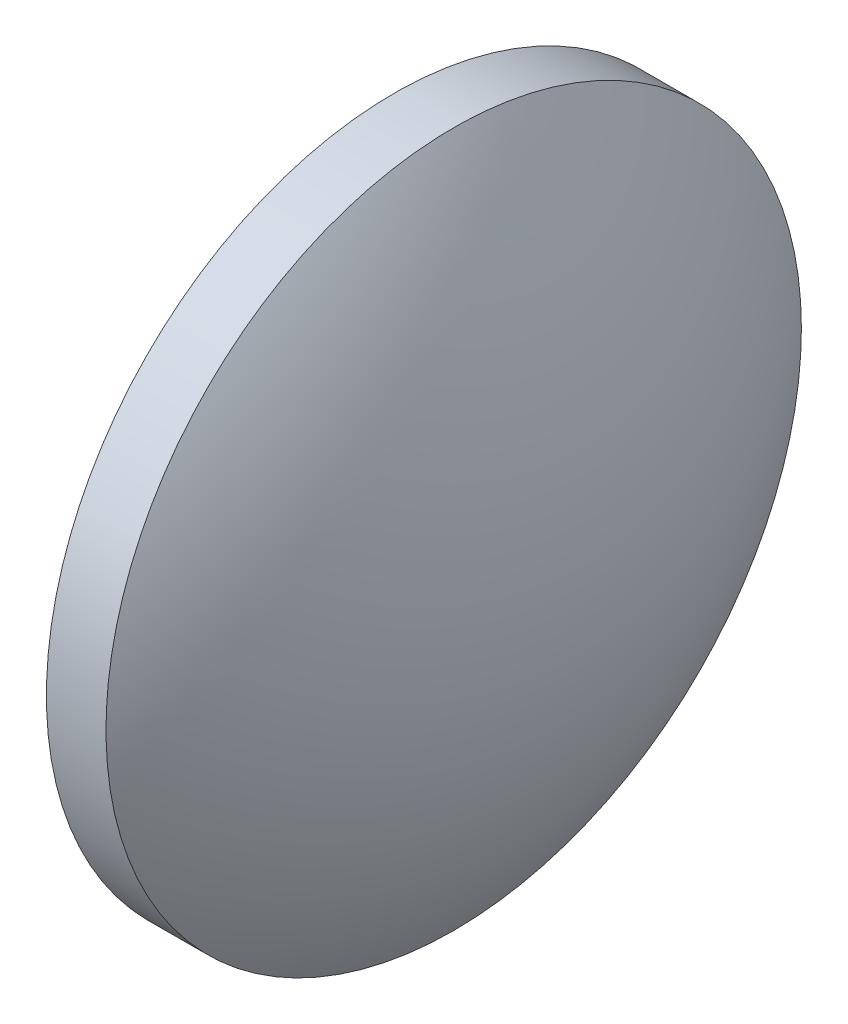
ISO-10303-21;
HEADER;
FILE_DESCRIPTION(('STEP AP214'),'2;1');
FILE_NAME('part.step','',(''),(''),'','','');
FILE_SCHEMA(('AUTOMOTIVE_DESIGN { 1 0 10303 214 1 1 1 1 }'));
ENDSEC;
DATA;
#1=APPLICATION_CONTEXT('core data for automotive mechanical design processes');
#2=APPLICATION_PROTOCOL_DEFINITION('international standard','automotive_design',2000,#1);
#3=PRODUCT_CONTEXT('',#1,'mechanical');
#4=PRODUCT('Part','Part','',(#3));
#5=PRODUCT_RELATED_PRODUCT_CATEGORY('part','',(#4));
#6=PRODUCT_DEFINITION_FORMATION('','',#4);
#7=PRODUCT_DEFINITION_CONTEXT('part definition',#1,'design');
#8=PRODUCT_DEFINITION('design','',#6,#7);
#9=PRODUCT_DEFINITION_SHAPE('','',#8);
#10=(LENGTH_UNIT() NAMED_UNIT(*) SI_UNIT(.MILLI.,.METRE.));
#11=(NAMED_UNIT(*) PLANE_ANGLE_UNIT() SI_UNIT($,.RADIAN.));
#12=(NAMED_UNIT(*) SI_UNIT($,.STERADIAN.) SOLID_ANGLE_UNIT());
#13=UNCERTAINTY_MEASURE_WITH_UNIT(LENGTH_MEASURE(1.E-05),#10,'distance_accuracy_value','');
#14=(GEOMETRIC_REPRESENTATION_CONTEXT(3) GLOBAL_UNCERTAINTY_ASSIGNED_CONTEXT((#13)) GLOBAL_UNIT_ASSIGNED_CONTEXT((#10,
#11,#12)) REPRESENTATION_CONTEXT('',''));
#15=CARTESIAN_POINT('',(0.,0.,0.));
#16=DIRECTION('',(0.,0.,1.));
#17=DIRECTION('',(1.,0.,0.));
#18=AXIS2_PLACEMENT_3D('',#15,#16,#17);
#19=CARTESIAN_POINT('',(98.7736064308381,65.2335549264122,0.));
#20=DIRECTION('',(1.,0.,0.));
#21=DIRECTION('',(0.,-1.,0.));
#22=AXIS2_PLACEMENT_3D('',#19,#20,#21);
#23=SPHERICAL_SURFACE('',#22,23.);
#24=CARTESIAN_POINT('',(117.949372386857,65.2335549264122,0.));
#25=DIRECTION('',(1.,0.,0.));
#26=DIRECTION('',(0.,0.,-1.));
#27=AXIS2_PLACEMENT_3D('',#24,#25,#26);
#28=CIRCLE('',#27,12.7);
#29=CARTESIAN_POINT('',(117.949372386857,65.2335549264122,-12.7));
#30=VERTEX_POINT('',#29);
#31=EDGE_CURVE('E10',#30,#30,#28,.T.);
#32=ORIENTED_EDGE('',*,*,#31,.T.);
#33=EDGE_LOOP('',(#32));
#34=FACE_BOUND('',#33,.T.);
#35=ADVANCED_FACE('F35',(#34),#23,.T.);
#36=CARTESIAN_POINT('',(121.773606430838,65.2335549264122,0.));
#37=DIRECTION('',(1.,0.,0.));
#38=DIRECTION('',(0.,0.,-1.));
#39=AXIS2_PLACEMENT_3D('',#36,#37,#38);
#40=CYLINDRICAL_SURFACE('',#39,12.7);
#41=CARTESIAN_POINT('',(115.773606430838,65.2335549264122,0.));
#42=DIRECTION('',(1.,0.,0.));
#43=DIRECTION('',(0.,0.,-1.));
#44=AXIS2_PLACEMENT_3D('',#41,#42,#43);
#45=CIRCLE('',#44,12.7);
#46=CARTESIAN_POINT('',(115.773606430838,65.2335549264122,-12.7));
#47=VERTEX_POINT('',#46);
#48=EDGE_CURVE('E41',#47,#47,#45,.T.);
#49=ORIENTED_EDGE('',*,*,#48,.T.);
#50=EDGE_LOOP('',(#49));
#51=FACE_BOUND('',#50,.T.);
#52=ORIENTED_EDGE('',*,*,#31,.F.);
#53=EDGE_LOOP('',(#52));
#54=FACE_BOUND('',#53,.T.);
#55=ADVANCED_FACE('F47',(#51,#54),#40,.T.);
#56=CARTESIAN_POINT('',(115.773606430838,65.2335549264122,0.));
#57=DIRECTION('',(-1.,0.,0.));
#58=DIRECTION('',(0.,0.,1.));
#59=AXIS2_PLACEMENT_3D('',#56,#57,#58);
#60=PLANE('',#59);
#61=ORIENTED_EDGE('',*,*,#48,.F.);
#62=EDGE_LOOP('',(#61));
#63=FACE_BOUND('',#62,.T.);
#64=ADVANCED_FACE('F50',(#63),#60,.T.);
#65=CLOSED_SHELL('',(#35,#55,#64));
#66=MANIFOLD_SOLID_BREP('B2',#65);
#67=ADVANCED_BREP_SHAPE_REPRESENTATION('',(#18,#66),#14);
#68=SHAPE_DEFINITION_REPRESENTATION(#9,#67);
ENDSEC;
END-ISO-10303-21;
